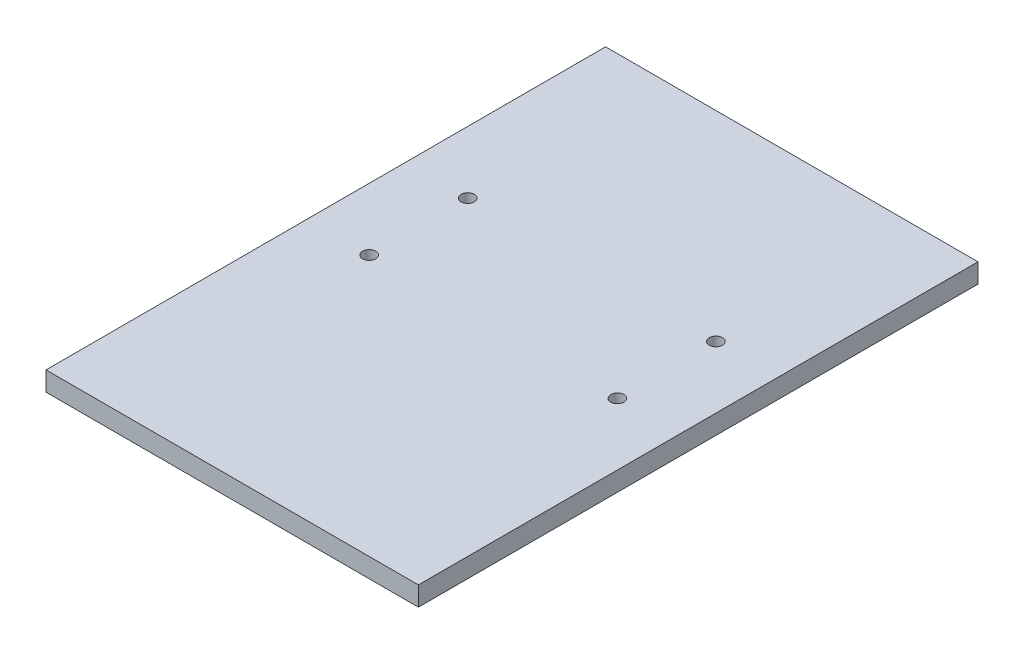
ISO-10303-21;
HEADER;
FILE_DESCRIPTION(('STEP AP214'),'2;1');
FILE_NAME('part.step','',(''),(''),'','','');
FILE_SCHEMA(('AUTOMOTIVE_DESIGN { 1 0 10303 214 1 1 1 1 }'));
ENDSEC;
DATA;
#1=APPLICATION_CONTEXT('core data for automotive mechanical design processes');
#2=APPLICATION_PROTOCOL_DEFINITION('international standard','automotive_design',2000,#1);
#3=PRODUCT_CONTEXT('',#1,'mechanical');
#4=PRODUCT('Part','Part','',(#3));
#5=PRODUCT_RELATED_PRODUCT_CATEGORY('part','',(#4));
#6=PRODUCT_DEFINITION_FORMATION('','',#4);
#7=PRODUCT_DEFINITION_CONTEXT('part definition',#1,'design');
#8=PRODUCT_DEFINITION('design','',#6,#7);
#9=PRODUCT_DEFINITION_SHAPE('','',#8);
#10=(LENGTH_UNIT() NAMED_UNIT(*) SI_UNIT(.MILLI.,.METRE.));
#11=(NAMED_UNIT(*) PLANE_ANGLE_UNIT() SI_UNIT($,.RADIAN.));
#12=(NAMED_UNIT(*) SI_UNIT($,.STERADIAN.) SOLID_ANGLE_UNIT());
#13=UNCERTAINTY_MEASURE_WITH_UNIT(LENGTH_MEASURE(1.E-05),#10,'distance_accuracy_value','');
#14=(GEOMETRIC_REPRESENTATION_CONTEXT(3) GLOBAL_UNCERTAINTY_ASSIGNED_CONTEXT((#13)) GLOBAL_UNIT_ASSIGNED_CONTEXT((#10,
#11,#12)) REPRESENTATION_CONTEXT('',''));
#15=CARTESIAN_POINT('',(0.,0.,0.));
#16=DIRECTION('',(0.,0.,1.));
#17=DIRECTION('',(1.,0.,0.));
#18=AXIS2_PLACEMENT_3D('',#15,#16,#17);
#19=CARTESIAN_POINT('',(120.015,12.446,-180.34));
#20=DIRECTION('',(-1.,0.,0.));
#21=DIRECTION('',(0.,0.,1.));
#22=AXIS2_PLACEMENT_3D('',#19,#20,#21);
#23=PLANE('',#22);
#24=DIRECTION('',(0.,0.,-1.));
#25=VECTOR('',#24,1.);
#26=CARTESIAN_POINT('',(120.015,0.,-180.34));
#27=LINE('',#26,#25);
#28=CARTESIAN_POINT('',(120.015,0.,180.34));
#29=VERTEX_POINT('',#28);
#30=CARTESIAN_POINT('',(120.015,0.,-180.34));
#31=VERTEX_POINT('',#30);
#32=EDGE_CURVE('E115',#29,#31,#27,.T.);
#33=ORIENTED_EDGE('',*,*,#32,.T.);
#34=DIRECTION('',(0.,-1.,0.));
#35=VECTOR('',#34,1.);
#36=CARTESIAN_POINT('',(120.015,12.446,-180.34));
#37=LINE('',#36,#35);
#38=CARTESIAN_POINT('',(120.015,12.446,-180.34));
#39=VERTEX_POINT('',#38);
#40=EDGE_CURVE('E11',#39,#31,#37,.T.);
#41=ORIENTED_EDGE('',*,*,#40,.F.);
#42=DIRECTION('',(0.,0.,-1.));
#43=VECTOR('',#42,1.);
#44=CARTESIAN_POINT('',(120.015,12.446,-180.34));
#45=LINE('',#44,#43);
#46=CARTESIAN_POINT('',(120.015,12.446,180.34));
#47=VERTEX_POINT('',#46);
#48=EDGE_CURVE('E97',#47,#39,#45,.T.);
#49=ORIENTED_EDGE('',*,*,#48,.F.);
#50=DIRECTION('',(0.,-1.,0.));
#51=VECTOR('',#50,1.);
#52=CARTESIAN_POINT('',(120.015,12.446,180.34));
#53=LINE('',#52,#51);
#54=EDGE_CURVE('E111',#47,#29,#53,.T.);
#55=ORIENTED_EDGE('',*,*,#54,.T.);
#56=EDGE_LOOP('',(#33,#41,#49,#55));
#57=FACE_BOUND('',#56,.T.);
#58=ADVANCED_FACE('F45',(#57),#23,.F.);
#59=CARTESIAN_POINT('',(-120.015,12.446,-180.34));
#60=DIRECTION('',(0.,0.,1.));
#61=DIRECTION('',(1.,0.,0.));
#62=AXIS2_PLACEMENT_3D('',#59,#60,#61);
#63=PLANE('',#62);
#64=DIRECTION('',(-1.,0.,0.));
#65=VECTOR('',#64,1.);
#66=CARTESIAN_POINT('',(-120.015,0.,-180.34));
#67=LINE('',#66,#65);
#68=CARTESIAN_POINT('',(-120.015,0.,-180.34));
#69=VERTEX_POINT('',#68);
#70=EDGE_CURVE('E102',#31,#69,#67,.T.);
#71=ORIENTED_EDGE('',*,*,#70,.T.);
#72=DIRECTION('',(0.,-1.,0.));
#73=VECTOR('',#72,1.);
#74=CARTESIAN_POINT('',(-120.015,12.446,-180.34));
#75=LINE('',#74,#73);
#76=CARTESIAN_POINT('',(-120.015,12.446,-180.34));
#77=VERTEX_POINT('',#76);
#78=EDGE_CURVE('E54',#77,#69,#75,.T.);
#79=ORIENTED_EDGE('',*,*,#78,.F.);
#80=DIRECTION('',(-1.,0.,0.));
#81=VECTOR('',#80,1.);
#82=CARTESIAN_POINT('',(-120.015,12.446,-180.34));
#83=LINE('',#82,#81);
#84=EDGE_CURVE('E92',#39,#77,#83,.T.);
#85=ORIENTED_EDGE('',*,*,#84,.F.);
#86=ORIENTED_EDGE('',*,*,#40,.T.);
#87=EDGE_LOOP('',(#71,#79,#85,#86));
#88=FACE_BOUND('',#87,.T.);
#89=ADVANCED_FACE('F101',(#88),#63,.F.);
#90=CARTESIAN_POINT('',(-120.015,12.446,-180.34));
#91=DIRECTION('',(1.,0.,0.));
#92=DIRECTION('',(0.,0.,-1.));
#93=AXIS2_PLACEMENT_3D('',#90,#91,#92);
#94=PLANE('',#93);
#95=DIRECTION('',(0.,0.,1.));
#96=VECTOR('',#95,1.);
#97=CARTESIAN_POINT('',(-120.015,0.,-180.34));
#98=LINE('',#97,#96);
#99=CARTESIAN_POINT('',(-120.015,0.,180.34));
#100=VERTEX_POINT('',#99);
#101=EDGE_CURVE('E79',#69,#100,#98,.T.);
#102=ORIENTED_EDGE('',*,*,#101,.T.);
#103=DIRECTION('',(0.,-1.,0.));
#104=VECTOR('',#103,1.);
#105=CARTESIAN_POINT('',(-120.015,12.446,180.34));
#106=LINE('',#105,#104);
#107=CARTESIAN_POINT('',(-120.015,12.446,180.34));
#108=VERTEX_POINT('',#107);
#109=EDGE_CURVE('E104',#108,#100,#106,.T.);
#110=ORIENTED_EDGE('',*,*,#109,.F.);
#111=DIRECTION('',(0.,0.,1.));
#112=VECTOR('',#111,1.);
#113=CARTESIAN_POINT('',(-120.015,12.446,-180.34));
#114=LINE('',#113,#112);
#115=EDGE_CURVE('E95',#77,#108,#114,.T.);
#116=ORIENTED_EDGE('',*,*,#115,.F.);
#117=ORIENTED_EDGE('',*,*,#78,.T.);
#118=EDGE_LOOP('',(#102,#110,#116,#117));
#119=FACE_BOUND('',#118,.T.);
#120=ADVANCED_FACE('F105',(#119),#94,.F.);
#121=CARTESIAN_POINT('',(-120.015,12.446,180.34));
#122=DIRECTION('',(0.,0.,-1.));
#123=DIRECTION('',(-1.,0.,0.));
#124=AXIS2_PLACEMENT_3D('',#121,#122,#123);
#125=PLANE('',#124);
#126=DIRECTION('',(1.,0.,0.));
#127=VECTOR('',#126,1.);
#128=CARTESIAN_POINT('',(-120.015,0.,180.34));
#129=LINE('',#128,#127);
#130=EDGE_CURVE('E85',#100,#29,#129,.T.);
#131=ORIENTED_EDGE('',*,*,#130,.T.);
#132=ORIENTED_EDGE('',*,*,#54,.F.);
#133=DIRECTION('',(1.,0.,0.));
#134=VECTOR('',#133,1.);
#135=CARTESIAN_POINT('',(-120.015,12.446,180.34));
#136=LINE('',#135,#134);
#137=EDGE_CURVE('E62',#108,#47,#136,.T.);
#138=ORIENTED_EDGE('',*,*,#137,.F.);
#139=ORIENTED_EDGE('',*,*,#109,.T.);
#140=EDGE_LOOP('',(#131,#132,#138,#139));
#141=FACE_BOUND('',#140,.T.);
#142=ADVANCED_FACE('F131',(#141),#125,.F.);
#143=CARTESIAN_POINT('',(0.,12.446,0.));
#144=DIRECTION('',(0.,1.,0.));
#145=DIRECTION('',(0.,0.,1.));
#146=AXIS2_PLACEMENT_3D('',#143,#144,#145);
#147=PLANE('',#146);
#148=CARTESIAN_POINT('',(-80.01,12.446,-51.435));
#149=DIRECTION('',(0.,1.,0.));
#150=DIRECTION('',(0.,0.,1.));
#151=AXIS2_PLACEMENT_3D('',#148,#149,#150);
#152=CIRCLE('',#151,4.24999999999999);
#153=CARTESIAN_POINT('',(-80.01,12.446,-47.185));
#154=VERTEX_POINT('',#153);
#155=EDGE_CURVE('E167',#154,#154,#152,.T.);
#156=ORIENTED_EDGE('',*,*,#155,.F.);
#157=EDGE_LOOP('',(#156));
#158=FACE_BOUND('',#157,.T.);
#159=CARTESIAN_POINT('',(-80.01,12.446,12.065));
#160=DIRECTION('',(0.,1.,0.));
#161=DIRECTION('',(0.,0.,1.));
#162=AXIS2_PLACEMENT_3D('',#159,#160,#161);
#163=CIRCLE('',#162,4.24999999999999);
#164=CARTESIAN_POINT('',(-80.01,12.446,16.315));
#165=VERTEX_POINT('',#164);
#166=EDGE_CURVE('E159',#165,#165,#163,.T.);
#167=ORIENTED_EDGE('',*,*,#166,.F.);
#168=EDGE_LOOP('',(#167));
#169=FACE_BOUND('',#168,.T.);
#170=CARTESIAN_POINT('',(80.01,12.446,-51.435));
#171=DIRECTION('',(0.,1.,0.));
#172=DIRECTION('',(0.,0.,1.));
#173=AXIS2_PLACEMENT_3D('',#170,#171,#172);
#174=CIRCLE('',#173,4.24999999999999);
#175=CARTESIAN_POINT('',(80.01,12.446,-47.185));
#176=VERTEX_POINT('',#175);
#177=EDGE_CURVE('E151',#176,#176,#174,.T.);
#178=ORIENTED_EDGE('',*,*,#177,.F.);
#179=EDGE_LOOP('',(#178));
#180=FACE_BOUND('',#179,.T.);
#181=CARTESIAN_POINT('',(80.01,12.446,12.065));
#182=DIRECTION('',(0.,1.,0.));
#183=DIRECTION('',(0.,0.,1.));
#184=AXIS2_PLACEMENT_3D('',#181,#182,#183);
#185=CIRCLE('',#184,4.24999999999999);
#186=CARTESIAN_POINT('',(80.01,12.446,16.315));
#187=VERTEX_POINT('',#186);
#188=EDGE_CURVE('E143',#187,#187,#185,.T.);
#189=ORIENTED_EDGE('',*,*,#188,.F.);
#190=EDGE_LOOP('',(#189));
#191=FACE_BOUND('',#190,.T.);
#192=ORIENTED_EDGE('',*,*,#48,.T.);
#193=ORIENTED_EDGE('',*,*,#84,.T.);
#194=ORIENTED_EDGE('',*,*,#115,.T.);
#195=ORIENTED_EDGE('',*,*,#137,.T.);
#196=EDGE_LOOP('',(#192,#193,#194,#195));
#197=FACE_BOUND('',#196,.T.);
#198=ADVANCED_FACE('F93',(#158,#169,#180,#191,#197),#147,.T.);
#199=CARTESIAN_POINT('',(0.,0.,0.));
#200=DIRECTION('',(0.,1.,0.));
#201=DIRECTION('',(0.,0.,1.));
#202=AXIS2_PLACEMENT_3D('',#199,#200,#201);
#203=PLANE('',#202);
#204=CARTESIAN_POINT('',(-80.01,0.,-51.435));
#205=DIRECTION('',(0.,1.,0.));
#206=DIRECTION('',(0.,0.,1.));
#207=AXIS2_PLACEMENT_3D('',#204,#205,#206);
#208=CIRCLE('',#207,4.24999999999999);
#209=CARTESIAN_POINT('',(-80.01,0.,-47.185));
#210=VERTEX_POINT('',#209);
#211=EDGE_CURVE('E163',#210,#210,#208,.T.);
#212=ORIENTED_EDGE('',*,*,#211,.T.);
#213=EDGE_LOOP('',(#212));
#214=FACE_BOUND('',#213,.T.);
#215=CARTESIAN_POINT('',(-80.01,0.,12.065));
#216=DIRECTION('',(0.,1.,0.));
#217=DIRECTION('',(0.,0.,1.));
#218=AXIS2_PLACEMENT_3D('',#215,#216,#217);
#219=CIRCLE('',#218,4.24999999999999);
#220=CARTESIAN_POINT('',(-80.01,0.,16.315));
#221=VERTEX_POINT('',#220);
#222=EDGE_CURVE('E155',#221,#221,#219,.T.);
#223=ORIENTED_EDGE('',*,*,#222,.T.);
#224=EDGE_LOOP('',(#223));
#225=FACE_BOUND('',#224,.T.);
#226=CARTESIAN_POINT('',(80.01,0.,-51.435));
#227=DIRECTION('',(0.,1.,0.));
#228=DIRECTION('',(0.,0.,1.));
#229=AXIS2_PLACEMENT_3D('',#226,#227,#228);
#230=CIRCLE('',#229,4.24999999999999);
#231=CARTESIAN_POINT('',(80.01,0.,-47.185));
#232=VERTEX_POINT('',#231);
#233=EDGE_CURVE('E147',#232,#232,#230,.T.);
#234=ORIENTED_EDGE('',*,*,#233,.T.);
#235=EDGE_LOOP('',(#234));
#236=FACE_BOUND('',#235,.T.);
#237=CARTESIAN_POINT('',(80.01,0.,12.065));
#238=DIRECTION('',(0.,1.,0.));
#239=DIRECTION('',(0.,0.,1.));
#240=AXIS2_PLACEMENT_3D('',#237,#238,#239);
#241=CIRCLE('',#240,4.24999999999999);
#242=CARTESIAN_POINT('',(80.01,0.,16.315));
#243=VERTEX_POINT('',#242);
#244=EDGE_CURVE('E119',#243,#243,#241,.T.);
#245=ORIENTED_EDGE('',*,*,#244,.T.);
#246=EDGE_LOOP('',(#245));
#247=FACE_BOUND('',#246,.T.);
#248=ORIENTED_EDGE('',*,*,#32,.F.);
#249=ORIENTED_EDGE('',*,*,#130,.F.);
#250=ORIENTED_EDGE('',*,*,#101,.F.);
#251=ORIENTED_EDGE('',*,*,#70,.F.);
#252=EDGE_LOOP('',(#248,#249,#250,#251));
#253=FACE_BOUND('',#252,.T.);
#254=ADVANCED_FACE('F134',(#214,#225,#236,#247,#253),#203,.F.);
#255=CARTESIAN_POINT('',(80.01,12.446,12.065));
#256=DIRECTION('',(0.,1.,0.));
#257=DIRECTION('',(0.,0.,1.));
#258=AXIS2_PLACEMENT_3D('',#255,#256,#257);
#259=CYLINDRICAL_SURFACE('',#258,4.24999999999999);
#260=ORIENTED_EDGE('',*,*,#244,.F.);
#261=EDGE_LOOP('',(#260));
#262=FACE_BOUND('',#261,.T.);
#263=ORIENTED_EDGE('',*,*,#188,.T.);
#264=EDGE_LOOP('',(#263));
#265=FACE_BOUND('',#264,.T.);
#266=ADVANCED_FACE('F185',(#262,#265),#259,.F.);
#267=CARTESIAN_POINT('',(80.01,12.446,-51.435));
#268=DIRECTION('',(0.,1.,0.));
#269=DIRECTION('',(0.,0.,1.));
#270=AXIS2_PLACEMENT_3D('',#267,#268,#269);
#271=CYLINDRICAL_SURFACE('',#270,4.24999999999999);
#272=ORIENTED_EDGE('',*,*,#233,.F.);
#273=EDGE_LOOP('',(#272));
#274=FACE_BOUND('',#273,.T.);
#275=ORIENTED_EDGE('',*,*,#177,.T.);
#276=EDGE_LOOP('',(#275));
#277=FACE_BOUND('',#276,.T.);
#278=ADVANCED_FACE('F187',(#274,#277),#271,.F.);
#279=CARTESIAN_POINT('',(-80.01,12.446,12.065));
#280=DIRECTION('',(0.,1.,0.));
#281=DIRECTION('',(0.,0.,1.));
#282=AXIS2_PLACEMENT_3D('',#279,#280,#281);
#283=CYLINDRICAL_SURFACE('',#282,4.24999999999999);
#284=ORIENTED_EDGE('',*,*,#222,.F.);
#285=EDGE_LOOP('',(#284));
#286=FACE_BOUND('',#285,.T.);
#287=ORIENTED_EDGE('',*,*,#166,.T.);
#288=EDGE_LOOP('',(#287));
#289=FACE_BOUND('',#288,.T.);
#290=ADVANCED_FACE('F194',(#286,#289),#283,.F.);
#291=CARTESIAN_POINT('',(-80.01,12.446,-51.435));
#292=DIRECTION('',(0.,1.,0.));
#293=DIRECTION('',(0.,0.,1.));
#294=AXIS2_PLACEMENT_3D('',#291,#292,#293);
#295=CYLINDRICAL_SURFACE('',#294,4.24999999999999);
#296=ORIENTED_EDGE('',*,*,#211,.F.);
#297=EDGE_LOOP('',(#296));
#298=FACE_BOUND('',#297,.T.);
#299=ORIENTED_EDGE('',*,*,#155,.T.);
#300=EDGE_LOOP('',(#299));
#301=FACE_BOUND('',#300,.T.);
#302=ADVANCED_FACE('F174',(#298,#301),#295,.F.);
#303=CLOSED_SHELL('',(#58,#89,#120,#142,#198,#254,#266,#278,#290,#302));
#304=MANIFOLD_SOLID_BREP('B2',#303);
#305=ADVANCED_BREP_SHAPE_REPRESENTATION('',(#18,#304),#14);
#306=SHAPE_DEFINITION_REPRESENTATION(#9,#305);
ENDSEC;
END-ISO-10303-21;
